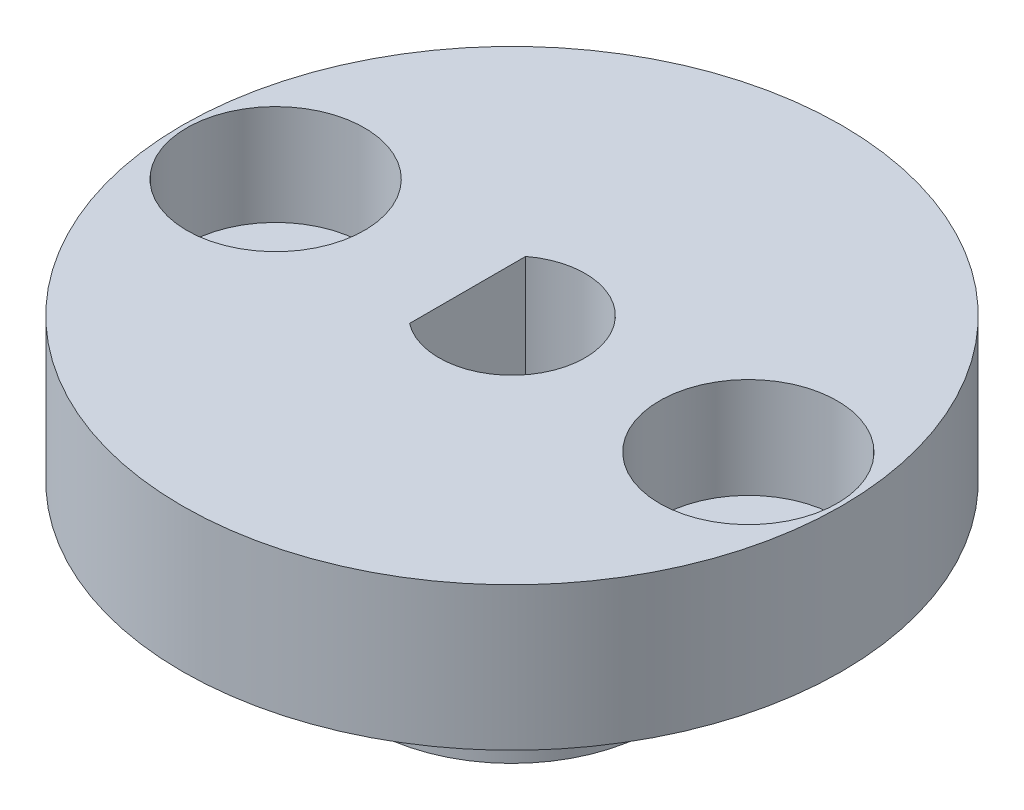
ISO-10303-21;
HEADER;
FILE_DESCRIPTION(('STEP AP214'),'2;1');
FILE_NAME('part.step','',(''),(''),'','','');
FILE_SCHEMA(('AUTOMOTIVE_DESIGN { 1 0 10303 214 1 1 1 1 }'));
ENDSEC;
DATA;
#1=APPLICATION_CONTEXT('core data for automotive mechanical design processes');
#2=APPLICATION_PROTOCOL_DEFINITION('international standard','automotive_design',2000,#1);
#3=PRODUCT_CONTEXT('',#1,'mechanical');
#4=PRODUCT('Part','Part','',(#3));
#5=PRODUCT_RELATED_PRODUCT_CATEGORY('part','',(#4));
#6=PRODUCT_DEFINITION_FORMATION('','',#4);
#7=PRODUCT_DEFINITION_CONTEXT('part definition',#1,'design');
#8=PRODUCT_DEFINITION('design','',#6,#7);
#9=PRODUCT_DEFINITION_SHAPE('','',#8);
#10=(LENGTH_UNIT() NAMED_UNIT(*) SI_UNIT(.MILLI.,.METRE.));
#11=(NAMED_UNIT(*) PLANE_ANGLE_UNIT() SI_UNIT($,.RADIAN.));
#12=(NAMED_UNIT(*) SI_UNIT($,.STERADIAN.) SOLID_ANGLE_UNIT());
#13=UNCERTAINTY_MEASURE_WITH_UNIT(LENGTH_MEASURE(1.E-05),#10,'distance_accuracy_value','');
#14=(GEOMETRIC_REPRESENTATION_CONTEXT(3) GLOBAL_UNCERTAINTY_ASSIGNED_CONTEXT((#13)) GLOBAL_UNIT_ASSIGNED_CONTEXT((#10,
#11,#12)) REPRESENTATION_CONTEXT('',''));
#15=CARTESIAN_POINT('',(0.,0.,0.));
#16=DIRECTION('',(0.,0.,1.));
#17=DIRECTION('',(1.,0.,0.));
#18=AXIS2_PLACEMENT_3D('',#15,#16,#17);
#19=CARTESIAN_POINT('',(8.245,5.,0.));
#20=DIRECTION('',(0.,-1.,0.));
#21=DIRECTION('',(0.,0.,-1.));
#22=AXIS2_PLACEMENT_3D('',#19,#20,#21);
#23=CYLINDRICAL_SURFACE('',#22,1.6);
#24=CARTESIAN_POINT('',(8.245,0.,0.));
#25=DIRECTION('',(0.,-1.,0.));
#26=DIRECTION('',(0.,0.,-1.));
#27=AXIS2_PLACEMENT_3D('',#24,#25,#26);
#28=CIRCLE('',#27,1.6);
#29=CARTESIAN_POINT('',(8.245,0.,-1.6));
#30=VERTEX_POINT('',#29);
#31=EDGE_CURVE('E66',#30,#30,#28,.T.);
#32=ORIENTED_EDGE('',*,*,#31,.T.);
#33=EDGE_LOOP('',(#32));
#34=FACE_BOUND('',#33,.T.);
#35=CARTESIAN_POINT('',(8.245,1.5,0.));
#36=DIRECTION('',(0.,1.,0.));
#37=DIRECTION('',(0.,0.,1.));
#38=AXIS2_PLACEMENT_3D('',#35,#36,#37);
#39=CIRCLE('',#38,1.6);
#40=CARTESIAN_POINT('',(8.245,1.5,1.6));
#41=VERTEX_POINT('',#40);
#42=EDGE_CURVE('E37',#41,#41,#39,.F.);
#43=ORIENTED_EDGE('',*,*,#42,.F.);
#44=EDGE_LOOP('',(#43));
#45=FACE_BOUND('',#44,.T.);
#46=ADVANCED_FACE('F33',(#34,#45),#23,.F.);
#47=CARTESIAN_POINT('',(-8.245,5.,0.));
#48=DIRECTION('',(0.,-1.,0.));
#49=DIRECTION('',(0.,0.,-1.));
#50=AXIS2_PLACEMENT_3D('',#47,#48,#49);
#51=CYLINDRICAL_SURFACE('',#50,1.6);
#52=CARTESIAN_POINT('',(-8.245,0.,0.));
#53=DIRECTION('',(0.,-1.,0.));
#54=DIRECTION('',(0.,0.,-1.));
#55=AXIS2_PLACEMENT_3D('',#52,#53,#54);
#56=CIRCLE('',#55,1.6);
#57=CARTESIAN_POINT('',(-8.245,0.,-1.6));
#58=VERTEX_POINT('',#57);
#59=EDGE_CURVE('E84',#58,#58,#56,.T.);
#60=ORIENTED_EDGE('',*,*,#59,.T.);
#61=EDGE_LOOP('',(#60));
#62=FACE_BOUND('',#61,.T.);
#63=CARTESIAN_POINT('',(-8.245,1.5,0.));
#64=DIRECTION('',(0.,1.,0.));
#65=DIRECTION('',(0.,0.,1.));
#66=AXIS2_PLACEMENT_3D('',#63,#64,#65);
#67=CIRCLE('',#66,1.6);
#68=CARTESIAN_POINT('',(-8.245,1.5,1.6));
#69=VERTEX_POINT('',#68);
#70=EDGE_CURVE('E78',#69,#69,#67,.F.);
#71=ORIENTED_EDGE('',*,*,#70,.F.);
#72=EDGE_LOOP('',(#71));
#73=FACE_BOUND('',#72,.T.);
#74=ADVANCED_FACE('F124',(#62,#73),#51,.F.);
#75=CARTESIAN_POINT('',(0.,5.,0.));
#76=DIRECTION('',(0.,-1.,0.));
#77=DIRECTION('',(0.,0.,-1.));
#78=AXIS2_PLACEMENT_3D('',#75,#76,#77);
#79=CYLINDRICAL_SURFACE('',#78,11.5);
#80=CARTESIAN_POINT('',(0.,5.,0.));
#81=DIRECTION('',(0.,1.,0.));
#82=DIRECTION('',(0.,0.,1.));
#83=AXIS2_PLACEMENT_3D('',#80,#81,#82);
#84=CIRCLE('',#83,11.5);
#85=CARTESIAN_POINT('',(0.,5.,11.5));
#86=VERTEX_POINT('',#85);
#87=EDGE_CURVE('E42',#86,#86,#84,.T.);
#88=ORIENTED_EDGE('',*,*,#87,.F.);
#89=EDGE_LOOP('',(#88));
#90=FACE_BOUND('',#89,.T.);
#91=CARTESIAN_POINT('',(0.,0.,0.));
#92=DIRECTION('',(0.,1.,0.));
#93=DIRECTION('',(0.,0.,1.));
#94=AXIS2_PLACEMENT_3D('',#91,#92,#93);
#95=CIRCLE('',#94,11.5);
#96=CARTESIAN_POINT('',(0.,0.,11.5));
#97=VERTEX_POINT('',#96);
#98=EDGE_CURVE('E91',#97,#97,#95,.T.);
#99=ORIENTED_EDGE('',*,*,#98,.T.);
#100=EDGE_LOOP('',(#99));
#101=FACE_BOUND('',#100,.T.);
#102=ADVANCED_FACE('F35',(#90,#101),#79,.T.);
#103=CARTESIAN_POINT('',(0.,5.,0.));
#104=DIRECTION('',(0.,1.,0.));
#105=DIRECTION('',(0.,0.,1.));
#106=AXIS2_PLACEMENT_3D('',#103,#104,#105);
#107=PLANE('',#106);
#108=CARTESIAN_POINT('',(-8.245,5.,0.));
#109=DIRECTION('',(0.,1.,0.));
#110=DIRECTION('',(0.,0.,1.));
#111=AXIS2_PLACEMENT_3D('',#108,#109,#110);
#112=CIRCLE('',#111,3.1);
#113=CARTESIAN_POINT('',(-8.245,5.,3.1));
#114=VERTEX_POINT('',#113);
#115=EDGE_CURVE('E101',#114,#114,#112,.T.);
#116=ORIENTED_EDGE('',*,*,#115,.F.);
#117=EDGE_LOOP('',(#116));
#118=FACE_BOUND('',#117,.T.);
#119=CARTESIAN_POINT('',(8.245,5.,0.));
#120=DIRECTION('',(0.,1.,0.));
#121=DIRECTION('',(0.,0.,1.));
#122=AXIS2_PLACEMENT_3D('',#119,#120,#121);
#123=CIRCLE('',#122,3.1);
#124=CARTESIAN_POINT('',(8.245,5.,3.1));
#125=VERTEX_POINT('',#124);
#126=EDGE_CURVE('E111',#125,#125,#123,.T.);
#127=ORIENTED_EDGE('',*,*,#126,.F.);
#128=EDGE_LOOP('',(#127));
#129=FACE_BOUND('',#128,.T.);
#130=CARTESIAN_POINT('',(0.,5.,0.));
#131=DIRECTION('',(0.,-1.,0.));
#132=DIRECTION('',(0.,0.,-1.));
#133=AXIS2_PLACEMENT_3D('',#130,#131,#132);
#134=CIRCLE('',#133,2.55);
#135=CARTESIAN_POINT('',(-1.55,5.,-2.02484567313166));
#136=VERTEX_POINT('',#135);
#137=CARTESIAN_POINT('',(-1.55,5.,2.02484567313166));
#138=VERTEX_POINT('',#137);
#139=EDGE_CURVE('E50',#136,#138,#134,.T.);
#140=ORIENTED_EDGE('',*,*,#139,.T.);
#141=DIRECTION('',(0.,0.,-1.));
#142=VECTOR('',#141,1.);
#143=CARTESIAN_POINT('',(-1.55,5.,2.02484567313166));
#144=LINE('',#143,#142);
#145=EDGE_CURVE('E80',#138,#136,#144,.T.);
#146=ORIENTED_EDGE('',*,*,#145,.T.);
#147=EDGE_LOOP('',(#140,#146));
#148=FACE_BOUND('',#147,.T.);
#149=ORIENTED_EDGE('',*,*,#87,.T.);
#150=EDGE_LOOP('',(#149));
#151=FACE_BOUND('',#150,.T.);
#152=ADVANCED_FACE('F114',(#118,#129,#148,#151),#107,.T.);
#153=CARTESIAN_POINT('',(0.,0.,0.));
#154=DIRECTION('',(0.,1.,0.));
#155=DIRECTION('',(0.,0.,1.));
#156=AXIS2_PLACEMENT_3D('',#153,#154,#155);
#157=PLANE('',#156);
#158=ORIENTED_EDGE('',*,*,#59,.F.);
#159=EDGE_LOOP('',(#158));
#160=FACE_BOUND('',#159,.T.);
#161=ORIENTED_EDGE('',*,*,#31,.F.);
#162=EDGE_LOOP('',(#161));
#163=FACE_BOUND('',#162,.T.);
#164=CARTESIAN_POINT('',(0.,0.,0.));
#165=DIRECTION('',(0.,-1.,0.));
#166=DIRECTION('',(0.,0.,-1.));
#167=AXIS2_PLACEMENT_3D('',#164,#165,#166);
#168=CIRCLE('',#167,4.99);
#169=CARTESIAN_POINT('',(0.,0.,-4.99));
#170=VERTEX_POINT('',#169);
#171=EDGE_CURVE('E11',#170,#170,#168,.T.);
#172=ORIENTED_EDGE('',*,*,#171,.F.);
#173=EDGE_LOOP('',(#172));
#174=FACE_BOUND('',#173,.T.);
#175=ORIENTED_EDGE('',*,*,#98,.F.);
#176=EDGE_LOOP('',(#175));
#177=FACE_BOUND('',#176,.T.);
#178=ADVANCED_FACE('F117',(#160,#163,#174,#177),#157,.F.);
#179=CARTESIAN_POINT('',(0.,-5.,0.));
#180=DIRECTION('',(0.,1.,0.));
#181=DIRECTION('',(0.,0.,1.));
#182=AXIS2_PLACEMENT_3D('',#179,#180,#181);
#183=CYLINDRICAL_SURFACE('',#182,4.99);
#184=CARTESIAN_POINT('',(0.,-5.,0.));
#185=DIRECTION('',(0.,-1.,0.));
#186=DIRECTION('',(0.,0.,-1.));
#187=AXIS2_PLACEMENT_3D('',#184,#185,#186);
#188=CIRCLE('',#187,4.99);
#189=CARTESIAN_POINT('',(0.,-5.,-4.99));
#190=VERTEX_POINT('',#189);
#191=EDGE_CURVE('E87',#190,#190,#188,.T.);
#192=ORIENTED_EDGE('',*,*,#191,.F.);
#193=EDGE_LOOP('',(#192));
#194=FACE_BOUND('',#193,.T.);
#195=ORIENTED_EDGE('',*,*,#171,.T.);
#196=EDGE_LOOP('',(#195));
#197=FACE_BOUND('',#196,.T.);
#198=ADVANCED_FACE('F128',(#194,#197),#183,.T.);
#199=CARTESIAN_POINT('',(0.,-5.,0.));
#200=DIRECTION('',(0.,-1.,0.));
#201=DIRECTION('',(0.,0.,-1.));
#202=AXIS2_PLACEMENT_3D('',#199,#200,#201);
#203=PLANE('',#202);
#204=CARTESIAN_POINT('',(0.,-5.,0.));
#205=DIRECTION('',(0.,-1.,0.));
#206=DIRECTION('',(0.,0.,-1.));
#207=AXIS2_PLACEMENT_3D('',#204,#205,#206);
#208=CIRCLE('',#207,2.55);
#209=CARTESIAN_POINT('',(-1.55,-5.,-2.02484567313166));
#210=VERTEX_POINT('',#209);
#211=CARTESIAN_POINT('',(-1.55,-5.,2.02484567313166));
#212=VERTEX_POINT('',#211);
#213=EDGE_CURVE('E55',#210,#212,#208,.T.);
#214=ORIENTED_EDGE('',*,*,#213,.F.);
#215=DIRECTION('',(0.,0.,-1.));
#216=VECTOR('',#215,1.);
#217=CARTESIAN_POINT('',(-1.55,-5.,2.02484567313166));
#218=LINE('',#217,#216);
#219=EDGE_CURVE('E70',#212,#210,#218,.T.);
#220=ORIENTED_EDGE('',*,*,#219,.F.);
#221=EDGE_LOOP('',(#214,#220));
#222=FACE_BOUND('',#221,.T.);
#223=ORIENTED_EDGE('',*,*,#191,.T.);
#224=EDGE_LOOP('',(#223));
#225=FACE_BOUND('',#224,.T.);
#226=ADVANCED_FACE('F74',(#222,#225),#203,.T.);
#227=CARTESIAN_POINT('',(0.,5.,0.));
#228=DIRECTION('',(0.,-1.,0.));
#229=DIRECTION('',(0.,0.,-1.));
#230=AXIS2_PLACEMENT_3D('',#227,#228,#229);
#231=CYLINDRICAL_SURFACE('',#230,2.55);
#232=ORIENTED_EDGE('',*,*,#213,.T.);
#233=DIRECTION('',(0.,-1.,0.));
#234=VECTOR('',#233,1.);
#235=CARTESIAN_POINT('',(-1.55,5.,2.02484567313166));
#236=LINE('',#235,#234);
#237=EDGE_CURVE('E67',#138,#212,#236,.T.);
#238=ORIENTED_EDGE('',*,*,#237,.F.);
#239=ORIENTED_EDGE('',*,*,#139,.F.);
#240=DIRECTION('',(0.,-1.,0.));
#241=VECTOR('',#240,1.);
#242=CARTESIAN_POINT('',(-1.55,5.,-2.02484567313166));
#243=LINE('',#242,#241);
#244=EDGE_CURVE('E60',#136,#210,#243,.T.);
#245=ORIENTED_EDGE('',*,*,#244,.T.);
#246=EDGE_LOOP('',(#232,#238,#239,#245));
#247=FACE_BOUND('',#246,.T.);
#248=ADVANCED_FACE('F62',(#247),#231,.F.);
#249=CARTESIAN_POINT('',(-1.55,5.,2.02484567313166));
#250=DIRECTION('',(-1.,0.,0.));
#251=DIRECTION('',(0.,0.,1.));
#252=AXIS2_PLACEMENT_3D('',#249,#250,#251);
#253=PLANE('',#252);
#254=ORIENTED_EDGE('',*,*,#219,.T.);
#255=ORIENTED_EDGE('',*,*,#244,.F.);
#256=ORIENTED_EDGE('',*,*,#145,.F.);
#257=ORIENTED_EDGE('',*,*,#237,.T.);
#258=EDGE_LOOP('',(#254,#255,#256,#257));
#259=FACE_BOUND('',#258,.T.);
#260=ADVANCED_FACE('F71',(#259),#253,.F.);
#261=CARTESIAN_POINT('',(-8.245,1.5,0.));
#262=DIRECTION('',(0.,1.,0.));
#263=DIRECTION('',(0.,0.,1.));
#264=AXIS2_PLACEMENT_3D('',#261,#262,#263);
#265=PLANE('',#264);
#266=CARTESIAN_POINT('',(-8.245,1.5,0.));
#267=DIRECTION('',(0.,1.,0.));
#268=DIRECTION('',(0.,0.,1.));
#269=AXIS2_PLACEMENT_3D('',#266,#267,#268);
#270=CIRCLE('',#269,3.1);
#271=CARTESIAN_POINT('',(-8.245,1.5,3.1));
#272=VERTEX_POINT('',#271);
#273=EDGE_CURVE('E97',#272,#272,#270,.T.);
#274=ORIENTED_EDGE('',*,*,#273,.T.);
#275=EDGE_LOOP('',(#274));
#276=FACE_BOUND('',#275,.T.);
#277=ORIENTED_EDGE('',*,*,#70,.T.);
#278=EDGE_LOOP('',(#277));
#279=FACE_BOUND('',#278,.T.);
#280=ADVANCED_FACE('F155',(#276,#279),#265,.T.);
#281=CARTESIAN_POINT('',(-8.245,1.5,0.));
#282=DIRECTION('',(0.,1.,0.));
#283=DIRECTION('',(0.,0.,1.));
#284=AXIS2_PLACEMENT_3D('',#281,#282,#283);
#285=CYLINDRICAL_SURFACE('',#284,3.1);
#286=ORIENTED_EDGE('',*,*,#273,.F.);
#287=EDGE_LOOP('',(#286));
#288=FACE_BOUND('',#287,.T.);
#289=ORIENTED_EDGE('',*,*,#115,.T.);
#290=EDGE_LOOP('',(#289));
#291=FACE_BOUND('',#290,.T.);
#292=ADVANCED_FACE('F165',(#288,#291),#285,.F.);
#293=CARTESIAN_POINT('',(8.245,1.5,0.));
#294=DIRECTION('',(0.,1.,0.));
#295=DIRECTION('',(0.,0.,1.));
#296=AXIS2_PLACEMENT_3D('',#293,#294,#295);
#297=PLANE('',#296);
#298=CARTESIAN_POINT('',(8.245,1.5,0.));
#299=DIRECTION('',(0.,1.,0.));
#300=DIRECTION('',(0.,0.,1.));
#301=AXIS2_PLACEMENT_3D('',#298,#299,#300);
#302=CIRCLE('',#301,3.1);
#303=CARTESIAN_POINT('',(8.245,1.5,3.1));
#304=VERTEX_POINT('',#303);
#305=EDGE_CURVE('E106',#304,#304,#302,.T.);
#306=ORIENTED_EDGE('',*,*,#305,.T.);
#307=EDGE_LOOP('',(#306));
#308=FACE_BOUND('',#307,.T.);
#309=ORIENTED_EDGE('',*,*,#42,.T.);
#310=EDGE_LOOP('',(#309));
#311=FACE_BOUND('',#310,.T.);
#312=ADVANCED_FACE('F161',(#308,#311),#297,.T.);
#313=CARTESIAN_POINT('',(8.245,1.5,0.));
#314=DIRECTION('',(0.,1.,0.));
#315=DIRECTION('',(0.,0.,1.));
#316=AXIS2_PLACEMENT_3D('',#313,#314,#315);
#317=CYLINDRICAL_SURFACE('',#316,3.1);
#318=ORIENTED_EDGE('',*,*,#305,.F.);
#319=EDGE_LOOP('',(#318));
#320=FACE_BOUND('',#319,.T.);
#321=ORIENTED_EDGE('',*,*,#126,.T.);
#322=EDGE_LOOP('',(#321));
#323=FACE_BOUND('',#322,.T.);
#324=ADVANCED_FACE('F158',(#320,#323),#317,.F.);
#325=CLOSED_SHELL('',(#46,#74,#102,#152,#178,#198,#226,#248,#260,#280,#292,#312,#324));
#326=MANIFOLD_SOLID_BREP('B2',#325);
#327=ADVANCED_BREP_SHAPE_REPRESENTATION('',(#18,#326),#14);
#328=SHAPE_DEFINITION_REPRESENTATION(#9,#327);
ENDSEC;
END-ISO-10303-21;
